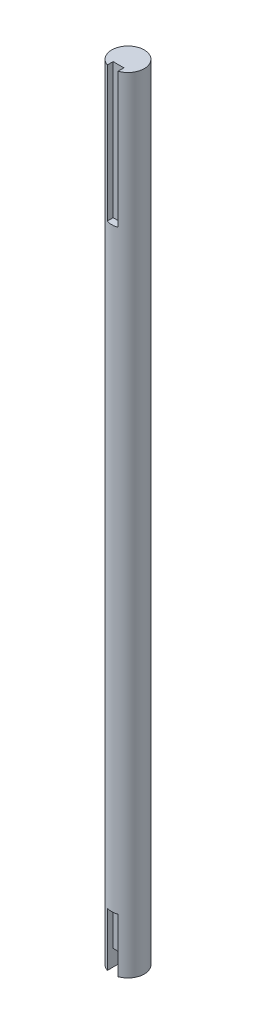
ISO-10303-21;
HEADER;
FILE_DESCRIPTION(('STEP AP214'),'2;1');
FILE_NAME('part.step','',(''),(''),'','','');
FILE_SCHEMA(('AUTOMOTIVE_DESIGN { 1 0 10303 214 1 1 1 1 }'));
ENDSEC;
DATA;
#1=APPLICATION_CONTEXT('core data for automotive mechanical design processes');
#2=APPLICATION_PROTOCOL_DEFINITION('international standard','automotive_design',2000,#1);
#3=PRODUCT_CONTEXT('',#1,'mechanical');
#4=PRODUCT('Part','Part','',(#3));
#5=PRODUCT_RELATED_PRODUCT_CATEGORY('part','',(#4));
#6=PRODUCT_DEFINITION_FORMATION('','',#4);
#7=PRODUCT_DEFINITION_CONTEXT('part definition',#1,'design');
#8=PRODUCT_DEFINITION('design','',#6,#7);
#9=PRODUCT_DEFINITION_SHAPE('','',#8);
#10=(LENGTH_UNIT() NAMED_UNIT(*) SI_UNIT(.MILLI.,.METRE.));
#11=(NAMED_UNIT(*) PLANE_ANGLE_UNIT() SI_UNIT($,.RADIAN.));
#12=(NAMED_UNIT(*) SI_UNIT($,.STERADIAN.) SOLID_ANGLE_UNIT());
#13=UNCERTAINTY_MEASURE_WITH_UNIT(LENGTH_MEASURE(1.E-05),#10,'distance_accuracy_value','');
#14=(GEOMETRIC_REPRESENTATION_CONTEXT(3) GLOBAL_UNCERTAINTY_ASSIGNED_CONTEXT((#13)) GLOBAL_UNIT_ASSIGNED_CONTEXT((#10,
#11,#12)) REPRESENTATION_CONTEXT('',''));
#15=CARTESIAN_POINT('',(0.,0.,0.));
#16=DIRECTION('',(0.,0.,1.));
#17=DIRECTION('',(1.,0.,0.));
#18=AXIS2_PLACEMENT_3D('',#15,#16,#17);
#19=CARTESIAN_POINT('',(0.,-36.,0.));
#20=DIRECTION('',(0.,1.,0.));
#21=DIRECTION('',(0.,0.,1.));
#22=AXIS2_PLACEMENT_3D('',#19,#20,#21);
#23=PLANE('',#22);
#24=DIRECTION('',(0.,0.,1.));
#25=VECTOR('',#24,1.);
#26=CARTESIAN_POINT('',(2.,-36.,0.));
#27=LINE('',#26,#25);
#28=CARTESIAN_POINT('',(2.,-36.,1.));
#29=VERTEX_POINT('',#28);
#30=CARTESIAN_POINT('',(2.,-36.,5.65685424949238));
#31=VERTEX_POINT('',#30);
#32=EDGE_CURVE('E214',#29,#31,#27,.T.);
#33=ORIENTED_EDGE('',*,*,#32,.F.);
#34=DIRECTION('',(-1.,0.,0.));
#35=VECTOR('',#34,1.);
#36=CARTESIAN_POINT('',(0.,-36.,1.));
#37=LINE('',#36,#35);
#38=CARTESIAN_POINT('',(-2.,-36.,0.999999999999999));
#39=VERTEX_POINT('',#38);
#40=EDGE_CURVE('E128',#29,#39,#37,.T.);
#41=ORIENTED_EDGE('',*,*,#40,.T.);
#42=DIRECTION('',(0.,0.,-1.));
#43=VECTOR('',#42,1.);
#44=CARTESIAN_POINT('',(-2.,-36.,0.));
#45=LINE('',#44,#43);
#46=CARTESIAN_POINT('',(-2.,-36.,5.65685424949238));
#47=VERTEX_POINT('',#46);
#48=EDGE_CURVE('E211',#47,#39,#45,.T.);
#49=ORIENTED_EDGE('',*,*,#48,.F.);
#50=CARTESIAN_POINT('',(0.,-36.,0.));
#51=DIRECTION('',(0.,1.,0.));
#52=DIRECTION('',(0.,0.,1.));
#53=AXIS2_PLACEMENT_3D('',#50,#51,#52);
#54=CIRCLE('',#53,6.);
#55=EDGE_CURVE('E207',#31,#47,#54,.T.);
#56=ORIENTED_EDGE('',*,*,#55,.F.);
#57=EDGE_LOOP('',(#33,#41,#49,#56));
#58=FACE_BOUND('',#57,.T.);
#59=ADVANCED_FACE('F41',(#58),#23,.F.);
#60=CARTESIAN_POINT('',(0.,-36.,0.));
#61=DIRECTION('',(0.,1.,0.));
#62=DIRECTION('',(0.,0.,1.));
#63=AXIS2_PLACEMENT_3D('',#60,#61,#62);
#64=CYLINDRICAL_SURFACE('',#63,6.);
#65=CARTESIAN_POINT('',(0.,-16.,0.));
#66=DIRECTION('',(0.,1.,0.));
#67=DIRECTION('',(0.,0.,1.));
#68=AXIS2_PLACEMENT_3D('',#65,#66,#67);
#69=CIRCLE('',#68,6.);
#70=CARTESIAN_POINT('',(2.,-16.,5.65685424949238));
#71=VERTEX_POINT('',#70);
#72=CARTESIAN_POINT('',(-2.,-16.,5.65685424949238));
#73=VERTEX_POINT('',#72);
#74=EDGE_CURVE('E217',#71,#73,#69,.F.);
#75=ORIENTED_EDGE('',*,*,#74,.F.);
#76=DIRECTION('',(0.,1.,0.));
#77=VECTOR('',#76,1.);
#78=CARTESIAN_POINT('',(2.,-36.,5.65685424949238));
#79=LINE('',#78,#77);
#80=EDGE_CURVE('E200',#71,#31,#79,.F.);
#81=ORIENTED_EDGE('',*,*,#80,.T.);
#82=ORIENTED_EDGE('',*,*,#55,.T.);
#83=DIRECTION('',(0.,1.,0.));
#84=VECTOR('',#83,1.);
#85=CARTESIAN_POINT('',(-2.,-36.,5.65685424949238));
#86=LINE('',#85,#84);
#87=EDGE_CURVE('E197',#47,#73,#86,.T.);
#88=ORIENTED_EDGE('',*,*,#87,.T.);
#89=EDGE_LOOP('',(#75,#81,#82,#88));
#90=FACE_BOUND('',#89,.T.);
#91=CARTESIAN_POINT('',(0.,204.,0.));
#92=DIRECTION('',(0.,-1.,0.));
#93=DIRECTION('',(0.,0.,-1.));
#94=AXIS2_PLACEMENT_3D('',#91,#92,#93);
#95=CIRCLE('',#94,6.);
#96=CARTESIAN_POINT('',(-2.,204.,5.65685424949238));
#97=VERTEX_POINT('',#96);
#98=CARTESIAN_POINT('',(2.,204.,5.65685424949238));
#99=VERTEX_POINT('',#98);
#100=EDGE_CURVE('E11',#97,#99,#95,.F.);
#101=ORIENTED_EDGE('',*,*,#100,.F.);
#102=DIRECTION('',(0.,1.,0.));
#103=VECTOR('',#102,1.);
#104=CARTESIAN_POINT('',(-2.,-36.,5.65685424949238));
#105=LINE('',#104,#103);
#106=CARTESIAN_POINT('',(-2.,254.,5.65685424949238));
#107=VERTEX_POINT('',#106);
#108=EDGE_CURVE('E177',#97,#107,#105,.T.);
#109=ORIENTED_EDGE('',*,*,#108,.T.);
#110=CARTESIAN_POINT('',(0.,254.,0.));
#111=DIRECTION('',(0.,1.,0.));
#112=DIRECTION('',(0.,0.,1.));
#113=AXIS2_PLACEMENT_3D('',#110,#111,#112);
#114=CIRCLE('',#113,6.);
#115=CARTESIAN_POINT('',(2.,254.,5.65685424949238));
#116=VERTEX_POINT('',#115);
#117=EDGE_CURVE('E203',#116,#107,#114,.T.);
#118=ORIENTED_EDGE('',*,*,#117,.F.);
#119=DIRECTION('',(0.,1.,0.));
#120=VECTOR('',#119,1.);
#121=CARTESIAN_POINT('',(2.,-36.,5.65685424949238));
#122=LINE('',#121,#120);
#123=EDGE_CURVE('E65',#116,#99,#122,.F.);
#124=ORIENTED_EDGE('',*,*,#123,.T.);
#125=EDGE_LOOP('',(#101,#109,#118,#124));
#126=FACE_BOUND('',#125,.T.);
#127=ADVANCED_FACE('F43',(#90,#126),#64,.T.);
#128=CARTESIAN_POINT('',(0.,254.,0.));
#129=DIRECTION('',(0.,1.,0.));
#130=DIRECTION('',(0.,0.,1.));
#131=AXIS2_PLACEMENT_3D('',#128,#129,#130);
#132=PLANE('',#131);
#133=ORIENTED_EDGE('',*,*,#117,.T.);
#134=DIRECTION('',(0.,0.,-1.));
#135=VECTOR('',#134,1.);
#136=CARTESIAN_POINT('',(-2.,254.,0.));
#137=LINE('',#136,#135);
#138=CARTESIAN_POINT('',(-2.,254.,3.5));
#139=VERTEX_POINT('',#138);
#140=EDGE_CURVE('E50',#107,#139,#137,.T.);
#141=ORIENTED_EDGE('',*,*,#140,.T.);
#142=DIRECTION('',(1.,0.,0.));
#143=VECTOR('',#142,1.);
#144=CARTESIAN_POINT('',(0.,254.,3.5));
#145=LINE('',#144,#143);
#146=CARTESIAN_POINT('',(2.,254.,3.5));
#147=VERTEX_POINT('',#146);
#148=EDGE_CURVE('E148',#139,#147,#145,.T.);
#149=ORIENTED_EDGE('',*,*,#148,.T.);
#150=DIRECTION('',(0.,0.,1.));
#151=VECTOR('',#150,1.);
#152=CARTESIAN_POINT('',(2.,254.,0.));
#153=LINE('',#152,#151);
#154=EDGE_CURVE('E157',#147,#116,#153,.T.);
#155=ORIENTED_EDGE('',*,*,#154,.T.);
#156=EDGE_LOOP('',(#133,#141,#149,#155));
#157=FACE_BOUND('',#156,.T.);
#158=ADVANCED_FACE('F223',(#157),#132,.T.);
#159=CARTESIAN_POINT('',(0.,-16.,3.5));
#160=DIRECTION('',(0.,0.,1.));
#161=DIRECTION('',(1.,0.,0.));
#162=AXIS2_PLACEMENT_3D('',#159,#160,#161);
#163=PLANE('',#162);
#164=DIRECTION('',(-1.,0.,0.));
#165=VECTOR('',#164,1.);
#166=CARTESIAN_POINT('',(0.,-30.,3.5));
#167=LINE('',#166,#165);
#168=CARTESIAN_POINT('',(2.,-30.,3.5));
#169=VERTEX_POINT('',#168);
#170=CARTESIAN_POINT('',(-2.,-30.,3.5));
#171=VERTEX_POINT('',#170);
#172=EDGE_CURVE('E143',#169,#171,#167,.T.);
#173=ORIENTED_EDGE('',*,*,#172,.F.);
#174=DIRECTION('',(0.,-1.,0.));
#175=VECTOR('',#174,1.);
#176=CARTESIAN_POINT('',(2.,-16.,3.5));
#177=LINE('',#176,#175);
#178=CARTESIAN_POINT('',(2.,-16.,3.5));
#179=VERTEX_POINT('',#178);
#180=EDGE_CURVE('E125',#179,#169,#177,.T.);
#181=ORIENTED_EDGE('',*,*,#180,.F.);
#182=DIRECTION('',(-1.,0.,0.));
#183=VECTOR('',#182,1.);
#184=CARTESIAN_POINT('',(0.,-16.,3.5));
#185=LINE('',#184,#183);
#186=CARTESIAN_POINT('',(-2.,-16.,3.5));
#187=VERTEX_POINT('',#186);
#188=EDGE_CURVE('E184',#179,#187,#185,.T.);
#189=ORIENTED_EDGE('',*,*,#188,.T.);
#190=DIRECTION('',(0.,-1.,0.));
#191=VECTOR('',#190,1.);
#192=CARTESIAN_POINT('',(-2.,-16.,3.5));
#193=LINE('',#192,#191);
#194=EDGE_CURVE('E191',#187,#171,#193,.T.);
#195=ORIENTED_EDGE('',*,*,#194,.T.);
#196=EDGE_LOOP('',(#173,#181,#189,#195));
#197=FACE_BOUND('',#196,.T.);
#198=ADVANCED_FACE('F257',(#197),#163,.T.);
#199=CARTESIAN_POINT('',(2.,-16.,0.));
#200=DIRECTION('',(-1.,0.,0.));
#201=DIRECTION('',(0.,0.,1.));
#202=AXIS2_PLACEMENT_3D('',#199,#200,#201);
#203=PLANE('',#202);
#204=ORIENTED_EDGE('',*,*,#180,.T.);
#205=DIRECTION('',(0.,0.,-1.));
#206=VECTOR('',#205,1.);
#207=CARTESIAN_POINT('',(2.,-30.,0.));
#208=LINE('',#207,#206);
#209=CARTESIAN_POINT('',(2.,-30.,1.));
#210=VERTEX_POINT('',#209);
#211=EDGE_CURVE('E57',#169,#210,#208,.T.);
#212=ORIENTED_EDGE('',*,*,#211,.T.);
#213=DIRECTION('',(0.,-1.,0.));
#214=VECTOR('',#213,1.);
#215=CARTESIAN_POINT('',(2.,-30.,1.));
#216=LINE('',#215,#214);
#217=EDGE_CURVE('E123',#210,#29,#216,.T.);
#218=ORIENTED_EDGE('',*,*,#217,.T.);
#219=ORIENTED_EDGE('',*,*,#32,.T.);
#220=ORIENTED_EDGE('',*,*,#80,.F.);
#221=DIRECTION('',(0.,0.,-1.));
#222=VECTOR('',#221,1.);
#223=CARTESIAN_POINT('',(2.,-16.,0.));
#224=LINE('',#223,#222);
#225=EDGE_CURVE('E181',#71,#179,#224,.T.);
#226=ORIENTED_EDGE('',*,*,#225,.T.);
#227=EDGE_LOOP('',(#204,#212,#218,#219,#220,#226));
#228=FACE_BOUND('',#227,.T.);
#229=ADVANCED_FACE('F120',(#228),#203,.T.);
#230=CARTESIAN_POINT('',(-2.,-16.,0.));
#231=DIRECTION('',(1.,0.,0.));
#232=DIRECTION('',(0.,0.,-1.));
#233=AXIS2_PLACEMENT_3D('',#230,#231,#232);
#234=PLANE('',#233);
#235=DIRECTION('',(0.,0.,1.));
#236=VECTOR('',#235,1.);
#237=CARTESIAN_POINT('',(-2.,-16.,0.));
#238=LINE('',#237,#236);
#239=EDGE_CURVE('E187',#187,#73,#238,.T.);
#240=ORIENTED_EDGE('',*,*,#239,.T.);
#241=ORIENTED_EDGE('',*,*,#87,.F.);
#242=ORIENTED_EDGE('',*,*,#48,.T.);
#243=DIRECTION('',(0.,-1.,0.));
#244=VECTOR('',#243,1.);
#245=CARTESIAN_POINT('',(-2.,-30.,0.999999999999999));
#246=LINE('',#245,#244);
#247=CARTESIAN_POINT('',(-2.,-30.,0.999999999999999));
#248=VERTEX_POINT('',#247);
#249=EDGE_CURVE('E144',#248,#39,#246,.T.);
#250=ORIENTED_EDGE('',*,*,#249,.F.);
#251=DIRECTION('',(0.,0.,1.));
#252=VECTOR('',#251,1.);
#253=CARTESIAN_POINT('',(-2.,-30.,0.));
#254=LINE('',#253,#252);
#255=EDGE_CURVE('E133',#248,#171,#254,.T.);
#256=ORIENTED_EDGE('',*,*,#255,.T.);
#257=ORIENTED_EDGE('',*,*,#194,.F.);
#258=EDGE_LOOP('',(#240,#241,#242,#250,#256,#257));
#259=FACE_BOUND('',#258,.T.);
#260=ADVANCED_FACE('F260',(#259),#234,.T.);
#261=CARTESIAN_POINT('',(0.,-16.,0.));
#262=DIRECTION('',(0.,1.,0.));
#263=DIRECTION('',(0.,0.,1.));
#264=AXIS2_PLACEMENT_3D('',#261,#262,#263);
#265=PLANE('',#264);
#266=ORIENTED_EDGE('',*,*,#74,.T.);
#267=ORIENTED_EDGE('',*,*,#239,.F.);
#268=ORIENTED_EDGE('',*,*,#188,.F.);
#269=ORIENTED_EDGE('',*,*,#225,.F.);
#270=EDGE_LOOP('',(#266,#267,#268,#269));
#271=FACE_BOUND('',#270,.T.);
#272=ADVANCED_FACE('F246',(#271),#265,.F.);
#273=CARTESIAN_POINT('',(-2.,204.,0.));
#274=DIRECTION('',(1.,0.,0.));
#275=DIRECTION('',(0.,0.,-1.));
#276=AXIS2_PLACEMENT_3D('',#273,#274,#275);
#277=PLANE('',#276);
#278=DIRECTION('',(0.,0.,-1.));
#279=VECTOR('',#278,1.);
#280=CARTESIAN_POINT('',(-2.,204.,0.));
#281=LINE('',#280,#279);
#282=CARTESIAN_POINT('',(-2.,204.,3.5));
#283=VERTEX_POINT('',#282);
#284=EDGE_CURVE('E153',#97,#283,#281,.T.);
#285=ORIENTED_EDGE('',*,*,#284,.T.);
#286=DIRECTION('',(0.,1.,0.));
#287=VECTOR('',#286,1.);
#288=CARTESIAN_POINT('',(-2.,204.,3.5));
#289=LINE('',#288,#287);
#290=EDGE_CURVE('E171',#283,#139,#289,.T.);
#291=ORIENTED_EDGE('',*,*,#290,.T.);
#292=ORIENTED_EDGE('',*,*,#140,.F.);
#293=ORIENTED_EDGE('',*,*,#108,.F.);
#294=EDGE_LOOP('',(#285,#291,#292,#293));
#295=FACE_BOUND('',#294,.T.);
#296=ADVANCED_FACE('F226',(#295),#277,.T.);
#297=CARTESIAN_POINT('',(0.,204.,3.5));
#298=DIRECTION('',(0.,0.,1.));
#299=DIRECTION('',(1.,0.,0.));
#300=AXIS2_PLACEMENT_3D('',#297,#298,#299);
#301=PLANE('',#300);
#302=ORIENTED_EDGE('',*,*,#148,.F.);
#303=ORIENTED_EDGE('',*,*,#290,.F.);
#304=DIRECTION('',(1.,0.,0.));
#305=VECTOR('',#304,1.);
#306=CARTESIAN_POINT('',(0.,204.,3.5));
#307=LINE('',#306,#305);
#308=CARTESIAN_POINT('',(2.,204.,3.5));
#309=VERTEX_POINT('',#308);
#310=EDGE_CURVE('E156',#283,#309,#307,.T.);
#311=ORIENTED_EDGE('',*,*,#310,.T.);
#312=DIRECTION('',(0.,1.,0.));
#313=VECTOR('',#312,1.);
#314=CARTESIAN_POINT('',(2.,204.,3.5));
#315=LINE('',#314,#313);
#316=EDGE_CURVE('E163',#309,#147,#315,.T.);
#317=ORIENTED_EDGE('',*,*,#316,.T.);
#318=EDGE_LOOP('',(#302,#303,#311,#317));
#319=FACE_BOUND('',#318,.T.);
#320=ADVANCED_FACE('F238',(#319),#301,.T.);
#321=CARTESIAN_POINT('',(2.,204.,0.));
#322=DIRECTION('',(-1.,0.,0.));
#323=DIRECTION('',(0.,0.,1.));
#324=AXIS2_PLACEMENT_3D('',#321,#322,#323);
#325=PLANE('',#324);
#326=ORIENTED_EDGE('',*,*,#154,.F.);
#327=ORIENTED_EDGE('',*,*,#316,.F.);
#328=DIRECTION('',(0.,0.,1.));
#329=VECTOR('',#328,1.);
#330=CARTESIAN_POINT('',(2.,204.,0.));
#331=LINE('',#330,#329);
#332=EDGE_CURVE('E160',#309,#99,#331,.T.);
#333=ORIENTED_EDGE('',*,*,#332,.T.);
#334=ORIENTED_EDGE('',*,*,#123,.F.);
#335=EDGE_LOOP('',(#326,#327,#333,#334));
#336=FACE_BOUND('',#335,.T.);
#337=ADVANCED_FACE('F236',(#336),#325,.T.);
#338=CARTESIAN_POINT('',(0.,204.,0.));
#339=DIRECTION('',(0.,-1.,0.));
#340=DIRECTION('',(0.,0.,-1.));
#341=AXIS2_PLACEMENT_3D('',#338,#339,#340);
#342=PLANE('',#341);
#343=ORIENTED_EDGE('',*,*,#100,.T.);
#344=ORIENTED_EDGE('',*,*,#332,.F.);
#345=ORIENTED_EDGE('',*,*,#310,.F.);
#346=ORIENTED_EDGE('',*,*,#284,.F.);
#347=EDGE_LOOP('',(#343,#344,#345,#346));
#348=FACE_BOUND('',#347,.T.);
#349=ADVANCED_FACE('F233',(#348),#342,.F.);
#350=CARTESIAN_POINT('',(0.,-30.,1.));
#351=DIRECTION('',(0.,0.,1.));
#352=DIRECTION('',(1.,0.,0.));
#353=AXIS2_PLACEMENT_3D('',#350,#351,#352);
#354=PLANE('',#353);
#355=ORIENTED_EDGE('',*,*,#40,.F.);
#356=ORIENTED_EDGE('',*,*,#217,.F.);
#357=DIRECTION('',(-1.,0.,0.));
#358=VECTOR('',#357,1.);
#359=CARTESIAN_POINT('',(0.,-30.,1.));
#360=LINE('',#359,#358);
#361=EDGE_CURVE('E127',#210,#248,#360,.T.);
#362=ORIENTED_EDGE('',*,*,#361,.T.);
#363=ORIENTED_EDGE('',*,*,#249,.T.);
#364=EDGE_LOOP('',(#355,#356,#362,#363));
#365=FACE_BOUND('',#364,.T.);
#366=ADVANCED_FACE('F140',(#365),#354,.T.);
#367=CARTESIAN_POINT('',(0.,-30.,0.));
#368=DIRECTION('',(0.,1.,0.));
#369=DIRECTION('',(0.,0.,1.));
#370=AXIS2_PLACEMENT_3D('',#367,#368,#369);
#371=PLANE('',#370);
#372=ORIENTED_EDGE('',*,*,#172,.T.);
#373=ORIENTED_EDGE('',*,*,#255,.F.);
#374=ORIENTED_EDGE('',*,*,#361,.F.);
#375=ORIENTED_EDGE('',*,*,#211,.F.);
#376=EDGE_LOOP('',(#372,#373,#374,#375));
#377=FACE_BOUND('',#376,.T.);
#378=ADVANCED_FACE('F131',(#377),#371,.F.);
#379=CLOSED_SHELL('',(#59,#127,#158,#198,#229,#260,#272,#296,#320,#337,#349,#366,#378));
#380=MANIFOLD_SOLID_BREP('B2',#379);
#381=ADVANCED_BREP_SHAPE_REPRESENTATION('',(#18,#380),#14);
#382=SHAPE_DEFINITION_REPRESENTATION(#9,#381);
ENDSEC;
END-ISO-10303-21;
